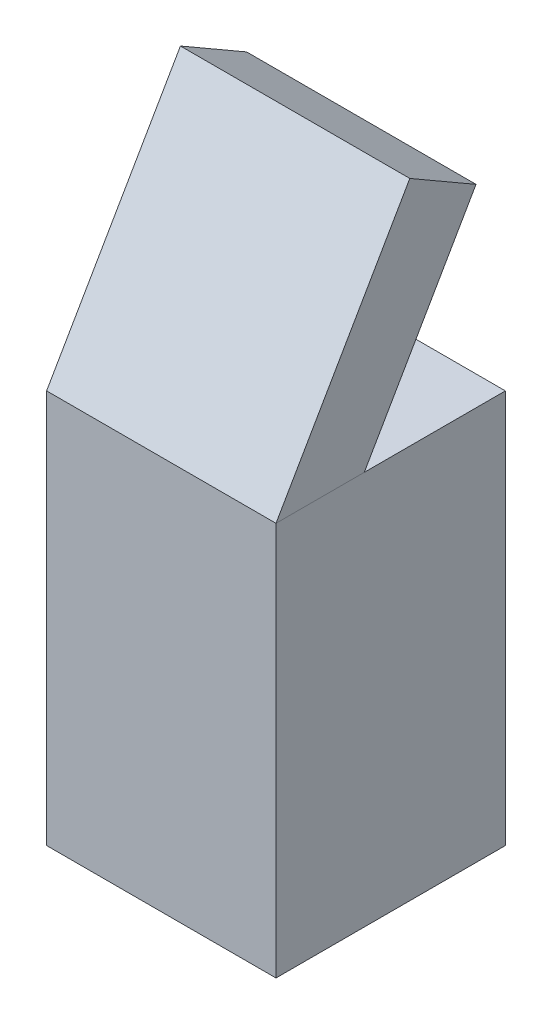
ISO-10303-21;
HEADER;
FILE_DESCRIPTION(('STEP AP214'),'2;1');
FILE_NAME('part.step','',(''),(''),'','','');
FILE_SCHEMA(('AUTOMOTIVE_DESIGN { 1 0 10303 214 1 1 1 1 }'));
ENDSEC;
DATA;
#1=APPLICATION_CONTEXT('core data for automotive mechanical design processes');
#2=APPLICATION_PROTOCOL_DEFINITION('international standard','automotive_design',2000,#1);
#3=PRODUCT_CONTEXT('',#1,'mechanical');
#4=PRODUCT('Part','Part','',(#3));
#5=PRODUCT_RELATED_PRODUCT_CATEGORY('part','',(#4));
#6=PRODUCT_DEFINITION_FORMATION('','',#4);
#7=PRODUCT_DEFINITION_CONTEXT('part definition',#1,'design');
#8=PRODUCT_DEFINITION('design','',#6,#7);
#9=PRODUCT_DEFINITION_SHAPE('','',#8);
#10=(LENGTH_UNIT() NAMED_UNIT(*) SI_UNIT(.MILLI.,.METRE.));
#11=(NAMED_UNIT(*) PLANE_ANGLE_UNIT() SI_UNIT($,.RADIAN.));
#12=(NAMED_UNIT(*) SI_UNIT($,.STERADIAN.) SOLID_ANGLE_UNIT());
#13=UNCERTAINTY_MEASURE_WITH_UNIT(LENGTH_MEASURE(1.E-05),#10,'distance_accuracy_value','');
#14=(GEOMETRIC_REPRESENTATION_CONTEXT(3) GLOBAL_UNCERTAINTY_ASSIGNED_CONTEXT((#13)) GLOBAL_UNIT_ASSIGNED_CONTEXT((#10,
#11,#12)) REPRESENTATION_CONTEXT('',''));
#15=CARTESIAN_POINT('',(0.,0.,0.));
#16=DIRECTION('',(0.,0.,1.));
#17=DIRECTION('',(1.,0.,0.));
#18=AXIS2_PLACEMENT_3D('',#15,#16,#17);
#19=CARTESIAN_POINT('',(-300.,1030.,69.0598923241498));
#20=DIRECTION('',(0.,-1.,0.));
#21=DIRECTION('',(0.,0.,-1.));
#22=AXIS2_PLACEMENT_3D('',#19,#20,#21);
#23=PLANE('',#22);
#24=DIRECTION('',(0.,0.,-1.));
#25=VECTOR('',#24,1.);
#26=CARTESIAN_POINT('',(300.,1030.,69.0598923241498));
#27=LINE('',#26,#25);
#28=CARTESIAN_POINT('',(300.,1030.,300.));
#29=VERTEX_POINT('',#28);
#30=CARTESIAN_POINT('',(300.,1030.,69.0598923241498));
#31=VERTEX_POINT('',#30);
#32=EDGE_CURVE('E107',#29,#31,#27,.T.);
#33=ORIENTED_EDGE('',*,*,#32,.F.);
#34=DIRECTION('',(1.,0.,0.));
#35=VECTOR('',#34,1.);
#36=CARTESIAN_POINT('',(-300.,1030.,300.));
#37=LINE('',#36,#35);
#38=CARTESIAN_POINT('',(-300.,1030.,300.));
#39=VERTEX_POINT('',#38);
#40=EDGE_CURVE('E12',#39,#29,#37,.T.);
#41=ORIENTED_EDGE('',*,*,#40,.F.);
#42=DIRECTION('',(0.,0.,-1.));
#43=VECTOR('',#42,1.);
#44=CARTESIAN_POINT('',(-300.,1030.,69.0598923241498));
#45=LINE('',#44,#43);
#46=CARTESIAN_POINT('',(-300.,1030.,69.0598923241498));
#47=VERTEX_POINT('',#46);
#48=EDGE_CURVE('E101',#39,#47,#45,.T.);
#49=ORIENTED_EDGE('',*,*,#48,.T.);
#50=DIRECTION('',(1.,0.,0.));
#51=VECTOR('',#50,1.);
#52=CARTESIAN_POINT('',(-300.,1030.,69.0598923241498));
#53=LINE('',#52,#51);
#54=EDGE_CURVE('E46',#47,#31,#53,.T.);
#55=ORIENTED_EDGE('',*,*,#54,.T.);
#56=EDGE_LOOP('',(#33,#41,#49,#55));
#57=FACE_BOUND('',#56,.T.);
#58=ADVANCED_FACE('F43',(#57),#23,.T.);
#59=CARTESIAN_POINT('',(-300.,1030.,300.));
#60=DIRECTION('',(0.,0.499999999999998,0.86602540378444));
#61=DIRECTION('',(0.,-0.86602540378444,0.499999999999998));
#62=AXIS2_PLACEMENT_3D('',#59,#60,#61);
#63=PLANE('',#62);
#64=DIRECTION('',(0.,-0.86602540378444,0.499999999999998));
#65=VECTOR('',#64,1.);
#66=CARTESIAN_POINT('',(300.,1030.,300.));
#67=LINE('',#66,#65);
#68=CARTESIAN_POINT('',(300.,1636.21778264911,-49.9999999999984));
#69=VERTEX_POINT('',#68);
#70=EDGE_CURVE('E103',#69,#29,#67,.T.);
#71=ORIENTED_EDGE('',*,*,#70,.F.);
#72=DIRECTION('',(1.,0.,0.));
#73=VECTOR('',#72,1.);
#74=CARTESIAN_POINT('',(-300.,1636.21778264911,-49.9999999999984));
#75=LINE('',#74,#73);
#76=CARTESIAN_POINT('',(-300.,1636.21778264911,-49.9999999999984));
#77=VERTEX_POINT('',#76);
#78=EDGE_CURVE('E52',#77,#69,#75,.T.);
#79=ORIENTED_EDGE('',*,*,#78,.F.);
#80=DIRECTION('',(0.,-0.86602540378444,0.499999999999998));
#81=VECTOR('',#80,1.);
#82=CARTESIAN_POINT('',(-300.,1030.,300.));
#83=LINE('',#82,#81);
#84=EDGE_CURVE('E98',#77,#39,#83,.T.);
#85=ORIENTED_EDGE('',*,*,#84,.T.);
#86=ORIENTED_EDGE('',*,*,#40,.T.);
#87=EDGE_LOOP('',(#71,#79,#85,#86));
#88=FACE_BOUND('',#87,.T.);
#89=ADVANCED_FACE('F117',(#88),#63,.T.);
#90=CARTESIAN_POINT('',(-300.,1636.21778264911,-49.9999999999984));
#91=DIRECTION('',(0.,0.866025403784438,-0.5));
#92=DIRECTION('',(0.,0.5,0.866025403784439));
#93=AXIS2_PLACEMENT_3D('',#90,#91,#92);
#94=PLANE('',#93);
#95=DIRECTION('',(0.,0.5,0.866025403784439));
#96=VECTOR('',#95,1.);
#97=CARTESIAN_POINT('',(300.,1636.21778264911,-49.9999999999984));
#98=LINE('',#97,#96);
#99=CARTESIAN_POINT('',(300.,1536.21778264911,-223.205080756888));
#100=VERTEX_POINT('',#99);
#101=EDGE_CURVE('E93',#100,#69,#98,.T.);
#102=ORIENTED_EDGE('',*,*,#101,.F.);
#103=DIRECTION('',(1.,0.,0.));
#104=VECTOR('',#103,1.);
#105=CARTESIAN_POINT('',(-300.,1536.21778264911,-223.205080756888));
#106=LINE('',#105,#104);
#107=CARTESIAN_POINT('',(-300.,1536.21778264911,-223.205080756888));
#108=VERTEX_POINT('',#107);
#109=EDGE_CURVE('E88',#108,#100,#106,.T.);
#110=ORIENTED_EDGE('',*,*,#109,.F.);
#111=DIRECTION('',(0.,0.5,0.866025403784439));
#112=VECTOR('',#111,1.);
#113=CARTESIAN_POINT('',(-300.,1636.21778264911,-49.9999999999984));
#114=LINE('',#113,#112);
#115=EDGE_CURVE('E91',#108,#77,#114,.T.);
#116=ORIENTED_EDGE('',*,*,#115,.T.);
#117=ORIENTED_EDGE('',*,*,#78,.T.);
#118=EDGE_LOOP('',(#102,#110,#116,#117));
#119=FACE_BOUND('',#118,.T.);
#120=ADVANCED_FACE('F90',(#119),#94,.T.);
#121=CARTESIAN_POINT('',(-300.,1536.21778264911,-223.205080756888));
#122=DIRECTION('',(0.,-0.5,-0.866025403784438));
#123=DIRECTION('',(0.,0.866025403784439,-0.5));
#124=AXIS2_PLACEMENT_3D('',#121,#122,#123);
#125=PLANE('',#124);
#126=DIRECTION('',(0.,0.866025403784439,-0.5));
#127=VECTOR('',#126,1.);
#128=CARTESIAN_POINT('',(300.,1536.21778264911,-223.205080756888));
#129=LINE('',#128,#127);
#130=EDGE_CURVE('E110',#31,#100,#129,.T.);
#131=ORIENTED_EDGE('',*,*,#130,.F.);
#132=ORIENTED_EDGE('',*,*,#54,.F.);
#133=DIRECTION('',(0.,0.866025403784439,-0.5));
#134=VECTOR('',#133,1.);
#135=CARTESIAN_POINT('',(-300.,1536.21778264911,-223.205080756888));
#136=LINE('',#135,#134);
#137=EDGE_CURVE('E97',#47,#108,#136,.T.);
#138=ORIENTED_EDGE('',*,*,#137,.T.);
#139=ORIENTED_EDGE('',*,*,#109,.T.);
#140=EDGE_LOOP('',(#131,#132,#138,#139));
#141=FACE_BOUND('',#140,.T.);
#142=ADVANCED_FACE('F100',(#141),#125,.T.);
#143=CARTESIAN_POINT('',(-300.,1030.,300.));
#144=DIRECTION('',(-1.,0.,0.));
#145=DIRECTION('',(0.,0.,1.));
#146=AXIS2_PLACEMENT_3D('',#143,#144,#145);
#147=PLANE('',#146);
#148=ORIENTED_EDGE('',*,*,#48,.F.);
#149=ORIENTED_EDGE('',*,*,#84,.F.);
#150=ORIENTED_EDGE('',*,*,#115,.F.);
#151=ORIENTED_EDGE('',*,*,#137,.F.);
#152=EDGE_LOOP('',(#148,#149,#150,#151));
#153=FACE_BOUND('',#152,.T.);
#154=ADVANCED_FACE('F96',(#153),#147,.T.);
#155=CARTESIAN_POINT('',(300.,1030.,300.));
#156=DIRECTION('',(-1.,0.,0.));
#157=DIRECTION('',(0.,0.,1.));
#158=AXIS2_PLACEMENT_3D('',#155,#156,#157);
#159=PLANE('',#158);
#160=ORIENTED_EDGE('',*,*,#32,.T.);
#161=ORIENTED_EDGE('',*,*,#130,.T.);
#162=ORIENTED_EDGE('',*,*,#101,.T.);
#163=ORIENTED_EDGE('',*,*,#70,.T.);
#164=EDGE_LOOP('',(#160,#161,#162,#163));
#165=FACE_BOUND('',#164,.T.);
#166=ADVANCED_FACE('F116',(#165),#159,.F.);
#167=CLOSED_SHELL('',(#58,#89,#120,#142,#154,#166));
#168=MANIFOLD_SOLID_BREP('B2',#167);
#169=CARTESIAN_POINT('',(300.,1030.,-300.));
#170=DIRECTION('',(-1.,0.,0.));
#171=DIRECTION('',(0.,0.,1.));
#172=AXIS2_PLACEMENT_3D('',#169,#170,#171);
#173=PLANE('',#172);
#174=DIRECTION('',(0.,0.,-1.));
#175=VECTOR('',#174,1.);
#176=CARTESIAN_POINT('',(300.,0.,-300.));
#177=LINE('',#176,#175);
#178=CARTESIAN_POINT('',(300.,0.,300.));
#179=VERTEX_POINT('',#178);
#180=CARTESIAN_POINT('',(300.,0.,-300.));
#181=VERTEX_POINT('',#180);
#182=EDGE_CURVE('E230',#179,#181,#177,.T.);
#183=ORIENTED_EDGE('',*,*,#182,.T.);
#184=DIRECTION('',(0.,-1.,0.));
#185=VECTOR('',#184,1.);
#186=CARTESIAN_POINT('',(300.,1030.,-300.));
#187=LINE('',#186,#185);
#188=CARTESIAN_POINT('',(300.,1030.,-300.));
#189=VERTEX_POINT('',#188);
#190=EDGE_CURVE('E41',#189,#181,#187,.T.);
#191=ORIENTED_EDGE('',*,*,#190,.F.);
#192=DIRECTION('',(0.,0.,-1.));
#193=VECTOR('',#192,1.);
#194=CARTESIAN_POINT('',(300.,1030.,-300.));
#195=LINE('',#194,#193);
#196=CARTESIAN_POINT('',(300.,1030.,300.));
#197=VERTEX_POINT('',#196);
#198=EDGE_CURVE('E218',#197,#189,#195,.T.);
#199=ORIENTED_EDGE('',*,*,#198,.F.);
#200=DIRECTION('',(0.,-1.,0.));
#201=VECTOR('',#200,1.);
#202=CARTESIAN_POINT('',(300.,1030.,300.));
#203=LINE('',#202,#201);
#204=EDGE_CURVE('E226',#197,#179,#203,.T.);
#205=ORIENTED_EDGE('',*,*,#204,.T.);
#206=EDGE_LOOP('',(#183,#191,#199,#205));
#207=FACE_BOUND('',#206,.T.);
#208=ADVANCED_FACE('F167',(#207),#173,.F.);
#209=CARTESIAN_POINT('',(-300.,1030.,-300.));
#210=DIRECTION('',(0.,0.,1.));
#211=DIRECTION('',(1.,0.,0.));
#212=AXIS2_PLACEMENT_3D('',#209,#210,#211);
#213=PLANE('',#212);
#214=DIRECTION('',(-1.,0.,0.));
#215=VECTOR('',#214,1.);
#216=CARTESIAN_POINT('',(-300.,0.,-300.));
#217=LINE('',#216,#215);
#218=CARTESIAN_POINT('',(-300.,0.,-300.));
#219=VERTEX_POINT('',#218);
#220=EDGE_CURVE('E222',#181,#219,#217,.T.);
#221=ORIENTED_EDGE('',*,*,#220,.T.);
#222=DIRECTION('',(0.,-1.,0.));
#223=VECTOR('',#222,1.);
#224=CARTESIAN_POINT('',(-300.,1030.,-300.));
#225=LINE('',#224,#223);
#226=CARTESIAN_POINT('',(-300.,1030.,-300.));
#227=VERTEX_POINT('',#226);
#228=EDGE_CURVE('E175',#227,#219,#225,.T.);
#229=ORIENTED_EDGE('',*,*,#228,.F.);
#230=DIRECTION('',(-1.,0.,0.));
#231=VECTOR('',#230,1.);
#232=CARTESIAN_POINT('',(-300.,1030.,-300.));
#233=LINE('',#232,#231);
#234=EDGE_CURVE('E213',#189,#227,#233,.T.);
#235=ORIENTED_EDGE('',*,*,#234,.F.);
#236=ORIENTED_EDGE('',*,*,#190,.T.);
#237=EDGE_LOOP('',(#221,#229,#235,#236));
#238=FACE_BOUND('',#237,.T.);
#239=ADVANCED_FACE('F221',(#238),#213,.F.);
#240=CARTESIAN_POINT('',(-300.,1030.,-300.));
#241=DIRECTION('',(1.,0.,0.));
#242=DIRECTION('',(0.,0.,-1.));
#243=AXIS2_PLACEMENT_3D('',#240,#241,#242);
#244=PLANE('',#243);
#245=DIRECTION('',(0.,0.,1.));
#246=VECTOR('',#245,1.);
#247=CARTESIAN_POINT('',(-300.,0.,-300.));
#248=LINE('',#247,#246);
#249=CARTESIAN_POINT('',(-300.,0.,300.));
#250=VERTEX_POINT('',#249);
#251=EDGE_CURVE('E200',#219,#250,#248,.T.);
#252=ORIENTED_EDGE('',*,*,#251,.T.);
#253=DIRECTION('',(0.,-1.,0.));
#254=VECTOR('',#253,1.);
#255=CARTESIAN_POINT('',(-300.,1030.,300.));
#256=LINE('',#255,#254);
#257=CARTESIAN_POINT('',(-300.,1030.,300.));
#258=VERTEX_POINT('',#257);
#259=EDGE_CURVE('E223',#258,#250,#256,.T.);
#260=ORIENTED_EDGE('',*,*,#259,.F.);
#261=DIRECTION('',(0.,0.,1.));
#262=VECTOR('',#261,1.);
#263=CARTESIAN_POINT('',(-300.,1030.,-300.));
#264=LINE('',#263,#262);
#265=EDGE_CURVE('E216',#227,#258,#264,.T.);
#266=ORIENTED_EDGE('',*,*,#265,.F.);
#267=ORIENTED_EDGE('',*,*,#228,.T.);
#268=EDGE_LOOP('',(#252,#260,#266,#267));
#269=FACE_BOUND('',#268,.T.);
#270=ADVANCED_FACE('F224',(#269),#244,.F.);
#271=CARTESIAN_POINT('',(-300.,1030.,300.));
#272=DIRECTION('',(0.,0.,-1.));
#273=DIRECTION('',(-1.,0.,0.));
#274=AXIS2_PLACEMENT_3D('',#271,#272,#273);
#275=PLANE('',#274);
#276=DIRECTION('',(1.,0.,0.));
#277=VECTOR('',#276,1.);
#278=CARTESIAN_POINT('',(-300.,0.,300.));
#279=LINE('',#278,#277);
#280=EDGE_CURVE('E206',#250,#179,#279,.T.);
#281=ORIENTED_EDGE('',*,*,#280,.T.);
#282=ORIENTED_EDGE('',*,*,#204,.F.);
#283=DIRECTION('',(1.,0.,0.));
#284=VECTOR('',#283,1.);
#285=CARTESIAN_POINT('',(-300.,1030.,300.));
#286=LINE('',#285,#284);
#287=EDGE_CURVE('E183',#258,#197,#286,.T.);
#288=ORIENTED_EDGE('',*,*,#287,.F.);
#289=ORIENTED_EDGE('',*,*,#259,.T.);
#290=EDGE_LOOP('',(#281,#282,#288,#289));
#291=FACE_BOUND('',#290,.T.);
#292=ADVANCED_FACE('F237',(#291),#275,.F.);
#293=CARTESIAN_POINT('',(300.,1030.,300.));
#294=DIRECTION('',(0.,1.,0.));
#295=DIRECTION('',(0.,0.,1.));
#296=AXIS2_PLACEMENT_3D('',#293,#294,#295);
#297=PLANE('',#296);
#298=ORIENTED_EDGE('',*,*,#198,.T.);
#299=ORIENTED_EDGE('',*,*,#234,.T.);
#300=ORIENTED_EDGE('',*,*,#265,.T.);
#301=ORIENTED_EDGE('',*,*,#287,.T.);
#302=EDGE_LOOP('',(#298,#299,#300,#301));
#303=FACE_BOUND('',#302,.T.);
#304=ADVANCED_FACE('F214',(#303),#297,.T.);
#305=CARTESIAN_POINT('',(300.,0.,300.));
#306=DIRECTION('',(0.,1.,0.));
#307=DIRECTION('',(0.,0.,1.));
#308=AXIS2_PLACEMENT_3D('',#305,#306,#307);
#309=PLANE('',#308);
#310=ORIENTED_EDGE('',*,*,#182,.F.);
#311=ORIENTED_EDGE('',*,*,#280,.F.);
#312=ORIENTED_EDGE('',*,*,#251,.F.);
#313=ORIENTED_EDGE('',*,*,#220,.F.);
#314=EDGE_LOOP('',(#310,#311,#312,#313));
#315=FACE_BOUND('',#314,.T.);
#316=ADVANCED_FACE('F240',(#315),#309,.F.);
#317=CLOSED_SHELL('',(#208,#239,#270,#292,#304,#316));
#318=MANIFOLD_SOLID_BREP('B6',#317);
#319=ADVANCED_BREP_SHAPE_REPRESENTATION('',(#18,#168,#318),#14);
#320=SHAPE_DEFINITION_REPRESENTATION(#9,#319);
ENDSEC;
END-ISO-10303-21;
